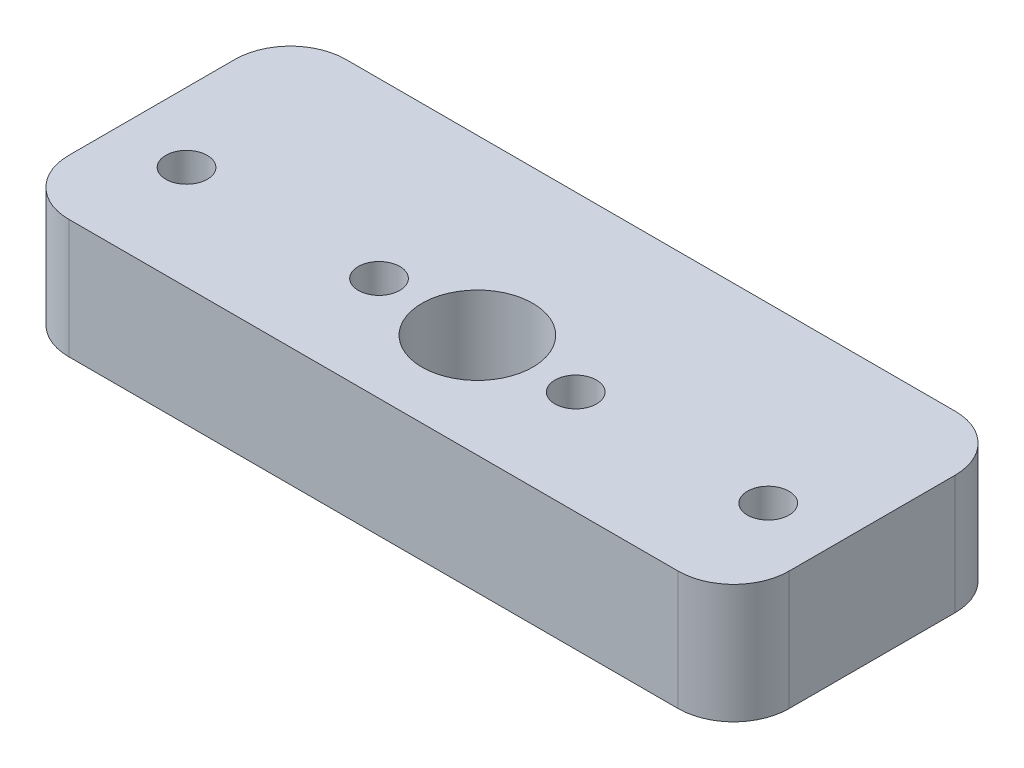
ISO-10303-21;
HEADER;
FILE_DESCRIPTION(('STEP AP214'),'2;1');
FILE_NAME('part.step','',(''),(''),'','','');
FILE_SCHEMA(('AUTOMOTIVE_DESIGN { 1 0 10303 214 1 1 1 1 }'));
ENDSEC;
DATA;
#1=APPLICATION_CONTEXT('core data for automotive mechanical design processes');
#2=APPLICATION_PROTOCOL_DEFINITION('international standard','automotive_design',2000,#1);
#3=PRODUCT_CONTEXT('',#1,'mechanical');
#4=PRODUCT('Part','Part','',(#3));
#5=PRODUCT_RELATED_PRODUCT_CATEGORY('part','',(#4));
#6=PRODUCT_DEFINITION_FORMATION('','',#4);
#7=PRODUCT_DEFINITION_CONTEXT('part definition',#1,'design');
#8=PRODUCT_DEFINITION('design','',#6,#7);
#9=PRODUCT_DEFINITION_SHAPE('','',#8);
#10=(LENGTH_UNIT() NAMED_UNIT(*) SI_UNIT(.MILLI.,.METRE.));
#11=(NAMED_UNIT(*) PLANE_ANGLE_UNIT() SI_UNIT($,.RADIAN.));
#12=(NAMED_UNIT(*) SI_UNIT($,.STERADIAN.) SOLID_ANGLE_UNIT());
#13=UNCERTAINTY_MEASURE_WITH_UNIT(LENGTH_MEASURE(1.E-05),#10,'distance_accuracy_value','');
#14=(GEOMETRIC_REPRESENTATION_CONTEXT(3) GLOBAL_UNCERTAINTY_ASSIGNED_CONTEXT((#13)) GLOBAL_UNIT_ASSIGNED_CONTEXT((#10,
#11,#12)) REPRESENTATION_CONTEXT('',''));
#15=CARTESIAN_POINT('',(0.,0.,0.));
#16=DIRECTION('',(0.,0.,1.));
#17=DIRECTION('',(1.,0.,0.));
#18=AXIS2_PLACEMENT_3D('',#15,#16,#17);
#19=CARTESIAN_POINT('',(-22.,8.6,6.));
#20=DIRECTION('',(0.,1.,0.));
#21=DIRECTION('',(0.,0.,1.));
#22=AXIS2_PLACEMENT_3D('',#19,#20,#21);
#23=PLANE('',#22);
#24=CARTESIAN_POINT('',(-21.,8.6,2.49999999999999));
#25=DIRECTION('',(0.,1.,0.));
#26=DIRECTION('',(0.,0.,-1.));
#27=AXIS2_PLACEMENT_3D('',#24,#25,#26);
#28=CIRCLE('',#27,1.5);
#29=CARTESIAN_POINT('',(-21.,8.6,0.999999999999989));
#30=VERTEX_POINT('',#29);
#31=EDGE_CURVE('E194',#30,#30,#28,.T.);
#32=ORIENTED_EDGE('',*,*,#31,.F.);
#33=EDGE_LOOP('',(#32));
#34=FACE_BOUND('',#33,.T.);
#35=CARTESIAN_POINT('',(7.1,8.6,2.49999999999999));
#36=DIRECTION('',(0.,1.,0.));
#37=DIRECTION('',(0.,0.,1.));
#38=AXIS2_PLACEMENT_3D('',#35,#36,#37);
#39=CIRCLE('',#38,1.5);
#40=CARTESIAN_POINT('',(7.1,8.6,3.99999999999999));
#41=VERTEX_POINT('',#40);
#42=EDGE_CURVE('E182',#41,#41,#39,.T.);
#43=ORIENTED_EDGE('',*,*,#42,.F.);
#44=EDGE_LOOP('',(#43));
#45=FACE_BOUND('',#44,.T.);
#46=CARTESIAN_POINT('',(-22.,8.6,6.));
#47=DIRECTION('',(0.,1.,0.));
#48=DIRECTION('',(0.,0.,1.));
#49=AXIS2_PLACEMENT_3D('',#46,#47,#48);
#50=CIRCLE('',#49,4.);
#51=CARTESIAN_POINT('',(-26.,8.6,5.99999999999997));
#52=VERTEX_POINT('',#51);
#53=CARTESIAN_POINT('',(-22.,8.6,10.));
#54=VERTEX_POINT('',#53);
#55=EDGE_CURVE('E145',#52,#54,#50,.T.);
#56=ORIENTED_EDGE('',*,*,#55,.T.);
#57=DIRECTION('',(1.,0.,0.));
#58=VECTOR('',#57,1.);
#59=CARTESIAN_POINT('',(-22.,8.6,10.));
#60=LINE('',#59,#58);
#61=CARTESIAN_POINT('',(22.,8.6,9.99999999999999));
#62=VERTEX_POINT('',#61);
#63=EDGE_CURVE('E93',#54,#62,#60,.T.);
#64=ORIENTED_EDGE('',*,*,#63,.T.);
#65=CARTESIAN_POINT('',(22.,8.6,6.));
#66=DIRECTION('',(0.,1.,0.));
#67=DIRECTION('',(0.,0.,1.));
#68=AXIS2_PLACEMENT_3D('',#65,#66,#67);
#69=CIRCLE('',#68,4.);
#70=CARTESIAN_POINT('',(26.,8.6,5.99999999999997));
#71=VERTEX_POINT('',#70);
#72=EDGE_CURVE('E160',#62,#71,#69,.T.);
#73=ORIENTED_EDGE('',*,*,#72,.T.);
#74=DIRECTION('',(0.,0.,-1.));
#75=VECTOR('',#74,1.);
#76=CARTESIAN_POINT('',(26.,8.6,-5.99999999999997));
#77=LINE('',#76,#75);
#78=CARTESIAN_POINT('',(26.,8.6,-5.99999999999998));
#79=VERTEX_POINT('',#78);
#80=EDGE_CURVE('E173',#71,#79,#77,.T.);
#81=ORIENTED_EDGE('',*,*,#80,.T.);
#82=CARTESIAN_POINT('',(22.,8.6,-6.));
#83=DIRECTION('',(0.,1.,0.));
#84=DIRECTION('',(0.,0.,-1.));
#85=AXIS2_PLACEMENT_3D('',#82,#83,#84);
#86=CIRCLE('',#85,4.);
#87=CARTESIAN_POINT('',(22.,8.6,-10.));
#88=VERTEX_POINT('',#87);
#89=EDGE_CURVE('E112',#79,#88,#86,.T.);
#90=ORIENTED_EDGE('',*,*,#89,.T.);
#91=DIRECTION('',(-1.,0.,0.));
#92=VECTOR('',#91,1.);
#93=CARTESIAN_POINT('',(-22.,8.6,-10.));
#94=LINE('',#93,#92);
#95=CARTESIAN_POINT('',(-22.,8.6,-10.));
#96=VERTEX_POINT('',#95);
#97=EDGE_CURVE('E106',#88,#96,#94,.T.);
#98=ORIENTED_EDGE('',*,*,#97,.T.);
#99=CARTESIAN_POINT('',(-22.,8.6,-6.));
#100=DIRECTION('',(0.,1.,0.));
#101=DIRECTION('',(0.,0.,1.));
#102=AXIS2_PLACEMENT_3D('',#99,#100,#101);
#103=CIRCLE('',#102,4.);
#104=CARTESIAN_POINT('',(-26.,8.6,-5.99999999999998));
#105=VERTEX_POINT('',#104);
#106=EDGE_CURVE('E110',#96,#105,#103,.T.);
#107=ORIENTED_EDGE('',*,*,#106,.T.);
#108=DIRECTION('',(0.,0.,1.));
#109=VECTOR('',#108,1.);
#110=CARTESIAN_POINT('',(-26.,8.6,-5.99999999999998));
#111=LINE('',#110,#109);
#112=EDGE_CURVE('E50',#105,#52,#111,.T.);
#113=ORIENTED_EDGE('',*,*,#112,.T.);
#114=EDGE_LOOP('',(#56,#64,#73,#81,#90,#98,#107,#113));
#115=FACE_BOUND('',#114,.T.);
#116=CARTESIAN_POINT('',(0.,8.6,2.49999999999999));
#117=DIRECTION('',(0.,1.,0.));
#118=DIRECTION('',(0.,0.,1.));
#119=AXIS2_PLACEMENT_3D('',#116,#117,#118);
#120=CIRCLE('',#119,4.);
#121=CARTESIAN_POINT('',(0.,8.6,6.49999999999999));
#122=VERTEX_POINT('',#121);
#123=EDGE_CURVE('E134',#122,#122,#120,.T.);
#124=ORIENTED_EDGE('',*,*,#123,.F.);
#125=EDGE_LOOP('',(#124));
#126=FACE_BOUND('',#125,.T.);
#127=CARTESIAN_POINT('',(21.,8.6,2.49999999999999));
#128=DIRECTION('',(0.,1.,0.));
#129=DIRECTION('',(0.,0.,1.));
#130=AXIS2_PLACEMENT_3D('',#127,#128,#129);
#131=CIRCLE('',#130,1.5);
#132=CARTESIAN_POINT('',(21.,8.6,3.99999999999999));
#133=VERTEX_POINT('',#132);
#134=EDGE_CURVE('E188',#133,#133,#131,.T.);
#135=ORIENTED_EDGE('',*,*,#134,.F.);
#136=EDGE_LOOP('',(#135));
#137=FACE_BOUND('',#136,.T.);
#138=CARTESIAN_POINT('',(-7.1,8.6,2.49999999999999));
#139=DIRECTION('',(0.,1.,0.));
#140=DIRECTION('',(0.,0.,-1.));
#141=AXIS2_PLACEMENT_3D('',#138,#139,#140);
#142=CIRCLE('',#141,1.5);
#143=CARTESIAN_POINT('',(-7.1,8.6,0.99999999999999));
#144=VERTEX_POINT('',#143);
#145=EDGE_CURVE('E200',#144,#144,#142,.T.);
#146=ORIENTED_EDGE('',*,*,#145,.F.);
#147=EDGE_LOOP('',(#146));
#148=FACE_BOUND('',#147,.T.);
#149=ADVANCED_FACE('F33',(#34,#45,#115,#126,#137,#148),#23,.T.);
#150=CARTESIAN_POINT('',(-22.,0.,6.));
#151=DIRECTION('',(0.,1.,0.));
#152=DIRECTION('',(0.,0.,1.));
#153=AXIS2_PLACEMENT_3D('',#150,#151,#152);
#154=PLANE('',#153);
#155=CARTESIAN_POINT('',(-21.,0.,2.49999999999999));
#156=DIRECTION('',(0.,1.,0.));
#157=DIRECTION('',(0.,0.,-1.));
#158=AXIS2_PLACEMENT_3D('',#155,#156,#157);
#159=CIRCLE('',#158,1.5);
#160=CARTESIAN_POINT('',(-21.,0.,0.999999999999989));
#161=VERTEX_POINT('',#160);
#162=EDGE_CURVE('E197',#161,#161,#159,.T.);
#163=ORIENTED_EDGE('',*,*,#162,.T.);
#164=EDGE_LOOP('',(#163));
#165=FACE_BOUND('',#164,.T.);
#166=CARTESIAN_POINT('',(7.1,0.,2.49999999999999));
#167=DIRECTION('',(0.,1.,0.));
#168=DIRECTION('',(0.,0.,1.));
#169=AXIS2_PLACEMENT_3D('',#166,#167,#168);
#170=CIRCLE('',#169,1.5);
#171=CARTESIAN_POINT('',(7.1,0.,3.99999999999999));
#172=VERTEX_POINT('',#171);
#173=EDGE_CURVE('E185',#172,#172,#170,.T.);
#174=ORIENTED_EDGE('',*,*,#173,.T.);
#175=EDGE_LOOP('',(#174));
#176=FACE_BOUND('',#175,.T.);
#177=CARTESIAN_POINT('',(-22.,0.,6.));
#178=DIRECTION('',(0.,1.,0.));
#179=DIRECTION('',(0.,0.,1.));
#180=AXIS2_PLACEMENT_3D('',#177,#178,#179);
#181=CIRCLE('',#180,4.);
#182=CARTESIAN_POINT('',(-26.,0.,5.99999999999997));
#183=VERTEX_POINT('',#182);
#184=CARTESIAN_POINT('',(-22.,0.,10.));
#185=VERTEX_POINT('',#184);
#186=EDGE_CURVE('E130',#183,#185,#181,.T.);
#187=ORIENTED_EDGE('',*,*,#186,.F.);
#188=DIRECTION('',(0.,0.,1.));
#189=VECTOR('',#188,1.);
#190=CARTESIAN_POINT('',(-26.,0.,-5.99999999999998));
#191=LINE('',#190,#189);
#192=CARTESIAN_POINT('',(-26.,0.,-5.99999999999998));
#193=VERTEX_POINT('',#192);
#194=EDGE_CURVE('E85',#193,#183,#191,.T.);
#195=ORIENTED_EDGE('',*,*,#194,.F.);
#196=CARTESIAN_POINT('',(-22.,0.,-6.));
#197=DIRECTION('',(0.,1.,0.));
#198=DIRECTION('',(0.,0.,1.));
#199=AXIS2_PLACEMENT_3D('',#196,#197,#198);
#200=CIRCLE('',#199,4.);
#201=CARTESIAN_POINT('',(-22.,0.,-10.));
#202=VERTEX_POINT('',#201);
#203=EDGE_CURVE('E79',#202,#193,#200,.T.);
#204=ORIENTED_EDGE('',*,*,#203,.F.);
#205=DIRECTION('',(-1.,0.,0.));
#206=VECTOR('',#205,1.);
#207=CARTESIAN_POINT('',(-22.,0.,-10.));
#208=LINE('',#207,#206);
#209=CARTESIAN_POINT('',(22.,0.,-10.));
#210=VERTEX_POINT('',#209);
#211=EDGE_CURVE('E120',#210,#202,#208,.T.);
#212=ORIENTED_EDGE('',*,*,#211,.F.);
#213=CARTESIAN_POINT('',(22.,0.,-6.));
#214=DIRECTION('',(0.,1.,0.));
#215=DIRECTION('',(0.,0.,-1.));
#216=AXIS2_PLACEMENT_3D('',#213,#214,#215);
#217=CIRCLE('',#216,4.);
#218=CARTESIAN_POINT('',(26.,0.,-5.99999999999998));
#219=VERTEX_POINT('',#218);
#220=EDGE_CURVE('E140',#219,#210,#217,.T.);
#221=ORIENTED_EDGE('',*,*,#220,.F.);
#222=DIRECTION('',(0.,0.,-1.));
#223=VECTOR('',#222,1.);
#224=CARTESIAN_POINT('',(26.,0.,-5.99999999999997));
#225=LINE('',#224,#223);
#226=CARTESIAN_POINT('',(26.,0.,5.99999999999997));
#227=VERTEX_POINT('',#226);
#228=EDGE_CURVE('E138',#227,#219,#225,.T.);
#229=ORIENTED_EDGE('',*,*,#228,.F.);
#230=CARTESIAN_POINT('',(22.,0.,6.));
#231=DIRECTION('',(0.,1.,0.));
#232=DIRECTION('',(0.,0.,1.));
#233=AXIS2_PLACEMENT_3D('',#230,#231,#232);
#234=CIRCLE('',#233,4.);
#235=CARTESIAN_POINT('',(22.,0.,9.99999999999999));
#236=VERTEX_POINT('',#235);
#237=EDGE_CURVE('E136',#236,#227,#234,.T.);
#238=ORIENTED_EDGE('',*,*,#237,.F.);
#239=DIRECTION('',(1.,0.,0.));
#240=VECTOR('',#239,1.);
#241=CARTESIAN_POINT('',(-22.,0.,10.));
#242=LINE('',#241,#240);
#243=EDGE_CURVE('E133',#185,#236,#242,.T.);
#244=ORIENTED_EDGE('',*,*,#243,.F.);
#245=EDGE_LOOP('',(#187,#195,#204,#212,#221,#229,#238,#244));
#246=FACE_BOUND('',#245,.T.);
#247=CARTESIAN_POINT('',(0.,0.,2.49999999999999));
#248=DIRECTION('',(0.,1.,0.));
#249=DIRECTION('',(0.,0.,1.));
#250=AXIS2_PLACEMENT_3D('',#247,#248,#249);
#251=CIRCLE('',#250,4.);
#252=CARTESIAN_POINT('',(0.,0.,6.49999999999999));
#253=VERTEX_POINT('',#252);
#254=EDGE_CURVE('E179',#253,#253,#251,.T.);
#255=ORIENTED_EDGE('',*,*,#254,.T.);
#256=EDGE_LOOP('',(#255));
#257=FACE_BOUND('',#256,.T.);
#258=CARTESIAN_POINT('',(21.,0.,2.49999999999999));
#259=DIRECTION('',(0.,1.,0.));
#260=DIRECTION('',(0.,0.,1.));
#261=AXIS2_PLACEMENT_3D('',#258,#259,#260);
#262=CIRCLE('',#261,1.5);
#263=CARTESIAN_POINT('',(21.,0.,3.99999999999999));
#264=VERTEX_POINT('',#263);
#265=EDGE_CURVE('E191',#264,#264,#262,.T.);
#266=ORIENTED_EDGE('',*,*,#265,.T.);
#267=EDGE_LOOP('',(#266));
#268=FACE_BOUND('',#267,.T.);
#269=CARTESIAN_POINT('',(-7.1,0.,2.49999999999999));
#270=DIRECTION('',(0.,1.,0.));
#271=DIRECTION('',(0.,0.,-1.));
#272=AXIS2_PLACEMENT_3D('',#269,#270,#271);
#273=CIRCLE('',#272,1.5);
#274=CARTESIAN_POINT('',(-7.1,0.,0.99999999999999));
#275=VERTEX_POINT('',#274);
#276=EDGE_CURVE('E203',#275,#275,#273,.T.);
#277=ORIENTED_EDGE('',*,*,#276,.T.);
#278=EDGE_LOOP('',(#277));
#279=FACE_BOUND('',#278,.T.);
#280=ADVANCED_FACE('F164',(#165,#176,#246,#257,#268,#279),#154,.F.);
#281=CARTESIAN_POINT('',(-22.,8.6,6.));
#282=DIRECTION('',(0.,-1.,0.));
#283=DIRECTION('',(0.,0.,-1.));
#284=AXIS2_PLACEMENT_3D('',#281,#282,#283);
#285=CYLINDRICAL_SURFACE('',#284,4.);
#286=ORIENTED_EDGE('',*,*,#186,.T.);
#287=DIRECTION('',(0.,-1.,0.));
#288=VECTOR('',#287,1.);
#289=CARTESIAN_POINT('',(-22.,8.6,10.));
#290=LINE('',#289,#288);
#291=EDGE_CURVE('E11',#54,#185,#290,.T.);
#292=ORIENTED_EDGE('',*,*,#291,.F.);
#293=ORIENTED_EDGE('',*,*,#55,.F.);
#294=DIRECTION('',(0.,-1.,0.));
#295=VECTOR('',#294,1.);
#296=CARTESIAN_POINT('',(-26.,8.6,5.99999999999997));
#297=LINE('',#296,#295);
#298=EDGE_CURVE('E126',#52,#183,#297,.T.);
#299=ORIENTED_EDGE('',*,*,#298,.T.);
#300=EDGE_LOOP('',(#286,#292,#293,#299));
#301=FACE_BOUND('',#300,.T.);
#302=ADVANCED_FACE('F35',(#301),#285,.T.);
#303=CARTESIAN_POINT('',(-22.,8.6,10.));
#304=DIRECTION('',(0.,0.,-1.));
#305=DIRECTION('',(-1.,0.,0.));
#306=AXIS2_PLACEMENT_3D('',#303,#304,#305);
#307=PLANE('',#306);
#308=ORIENTED_EDGE('',*,*,#243,.T.);
#309=DIRECTION('',(0.,-1.,0.));
#310=VECTOR('',#309,1.);
#311=CARTESIAN_POINT('',(22.,8.6,9.99999999999999));
#312=LINE('',#311,#310);
#313=EDGE_CURVE('E42',#62,#236,#312,.T.);
#314=ORIENTED_EDGE('',*,*,#313,.F.);
#315=ORIENTED_EDGE('',*,*,#63,.F.);
#316=ORIENTED_EDGE('',*,*,#291,.T.);
#317=EDGE_LOOP('',(#308,#314,#315,#316));
#318=FACE_BOUND('',#317,.T.);
#319=ADVANCED_FACE('F238',(#318),#307,.F.);
#320=CARTESIAN_POINT('',(22.,8.6,6.));
#321=DIRECTION('',(0.,-1.,0.));
#322=DIRECTION('',(0.,0.,-1.));
#323=AXIS2_PLACEMENT_3D('',#320,#321,#322);
#324=CYLINDRICAL_SURFACE('',#323,4.);
#325=ORIENTED_EDGE('',*,*,#237,.T.);
#326=DIRECTION('',(0.,-1.,0.));
#327=VECTOR('',#326,1.);
#328=CARTESIAN_POINT('',(26.,8.6,5.99999999999997));
#329=LINE('',#328,#327);
#330=EDGE_CURVE('E152',#71,#227,#329,.T.);
#331=ORIENTED_EDGE('',*,*,#330,.F.);
#332=ORIENTED_EDGE('',*,*,#72,.F.);
#333=ORIENTED_EDGE('',*,*,#313,.T.);
#334=EDGE_LOOP('',(#325,#331,#332,#333));
#335=FACE_BOUND('',#334,.T.);
#336=ADVANCED_FACE('F158',(#335),#324,.T.);
#337=CARTESIAN_POINT('',(26.,8.6,-5.99999999999997));
#338=DIRECTION('',(-1.,0.,0.));
#339=DIRECTION('',(0.,0.,1.));
#340=AXIS2_PLACEMENT_3D('',#337,#338,#339);
#341=PLANE('',#340);
#342=ORIENTED_EDGE('',*,*,#228,.T.);
#343=DIRECTION('',(0.,-1.,0.));
#344=VECTOR('',#343,1.);
#345=CARTESIAN_POINT('',(26.,8.6,-5.99999999999998));
#346=LINE('',#345,#344);
#347=EDGE_CURVE('E149',#79,#219,#346,.T.);
#348=ORIENTED_EDGE('',*,*,#347,.F.);
#349=ORIENTED_EDGE('',*,*,#80,.F.);
#350=ORIENTED_EDGE('',*,*,#330,.T.);
#351=EDGE_LOOP('',(#342,#348,#349,#350));
#352=FACE_BOUND('',#351,.T.);
#353=ADVANCED_FACE('F169',(#352),#341,.F.);
#354=CARTESIAN_POINT('',(22.,8.6,-6.));
#355=DIRECTION('',(0.,-1.,0.));
#356=DIRECTION('',(0.,0.,-1.));
#357=AXIS2_PLACEMENT_3D('',#354,#355,#356);
#358=CYLINDRICAL_SURFACE('',#357,4.);
#359=ORIENTED_EDGE('',*,*,#220,.T.);
#360=DIRECTION('',(0.,-1.,0.));
#361=VECTOR('',#360,1.);
#362=CARTESIAN_POINT('',(22.,8.6,-10.));
#363=LINE('',#362,#361);
#364=EDGE_CURVE('E121',#88,#210,#363,.T.);
#365=ORIENTED_EDGE('',*,*,#364,.F.);
#366=ORIENTED_EDGE('',*,*,#89,.F.);
#367=ORIENTED_EDGE('',*,*,#347,.T.);
#368=EDGE_LOOP('',(#359,#365,#366,#367));
#369=FACE_BOUND('',#368,.T.);
#370=ADVANCED_FACE('F172',(#369),#358,.T.);
#371=CARTESIAN_POINT('',(-22.,8.6,-10.));
#372=DIRECTION('',(0.,0.,1.));
#373=DIRECTION('',(1.,0.,0.));
#374=AXIS2_PLACEMENT_3D('',#371,#372,#373);
#375=PLANE('',#374);
#376=ORIENTED_EDGE('',*,*,#211,.T.);
#377=DIRECTION('',(0.,-1.,0.));
#378=VECTOR('',#377,1.);
#379=CARTESIAN_POINT('',(-22.,8.6,-10.));
#380=LINE('',#379,#378);
#381=EDGE_CURVE('E117',#96,#202,#380,.T.);
#382=ORIENTED_EDGE('',*,*,#381,.F.);
#383=ORIENTED_EDGE('',*,*,#97,.F.);
#384=ORIENTED_EDGE('',*,*,#364,.T.);
#385=EDGE_LOOP('',(#376,#382,#383,#384));
#386=FACE_BOUND('',#385,.T.);
#387=ADVANCED_FACE('F118',(#386),#375,.F.);
#388=CARTESIAN_POINT('',(-22.,8.6,-6.));
#389=DIRECTION('',(0.,-1.,0.));
#390=DIRECTION('',(0.,0.,-1.));
#391=AXIS2_PLACEMENT_3D('',#388,#389,#390);
#392=CYLINDRICAL_SURFACE('',#391,4.);
#393=ORIENTED_EDGE('',*,*,#203,.T.);
#394=DIRECTION('',(0.,-1.,0.));
#395=VECTOR('',#394,1.);
#396=CARTESIAN_POINT('',(-26.,8.6,-5.99999999999998));
#397=LINE('',#396,#395);
#398=EDGE_CURVE('E122',#105,#193,#397,.T.);
#399=ORIENTED_EDGE('',*,*,#398,.F.);
#400=ORIENTED_EDGE('',*,*,#106,.F.);
#401=ORIENTED_EDGE('',*,*,#381,.T.);
#402=EDGE_LOOP('',(#393,#399,#400,#401));
#403=FACE_BOUND('',#402,.T.);
#404=ADVANCED_FACE('F124',(#403),#392,.T.);
#405=CARTESIAN_POINT('',(-26.,8.6,-5.99999999999998));
#406=DIRECTION('',(1.,0.,0.));
#407=DIRECTION('',(0.,0.,-1.));
#408=AXIS2_PLACEMENT_3D('',#405,#406,#407);
#409=PLANE('',#408);
#410=ORIENTED_EDGE('',*,*,#194,.T.);
#411=ORIENTED_EDGE('',*,*,#298,.F.);
#412=ORIENTED_EDGE('',*,*,#112,.F.);
#413=ORIENTED_EDGE('',*,*,#398,.T.);
#414=EDGE_LOOP('',(#410,#411,#412,#413));
#415=FACE_BOUND('',#414,.T.);
#416=ADVANCED_FACE('F226',(#415),#409,.F.);
#417=CARTESIAN_POINT('',(0.,8.6,2.49999999999999));
#418=DIRECTION('',(0.,-1.,0.));
#419=DIRECTION('',(0.,0.,-1.));
#420=AXIS2_PLACEMENT_3D('',#417,#418,#419);
#421=CYLINDRICAL_SURFACE('',#420,4.);
#422=ORIENTED_EDGE('',*,*,#123,.T.);
#423=EDGE_LOOP('',(#422));
#424=FACE_BOUND('',#423,.T.);
#425=ORIENTED_EDGE('',*,*,#254,.F.);
#426=EDGE_LOOP('',(#425));
#427=FACE_BOUND('',#426,.T.);
#428=ADVANCED_FACE('F223',(#424,#427),#421,.F.);
#429=CARTESIAN_POINT('',(7.1,8.6,2.49999999999999));
#430=DIRECTION('',(0.,-1.,0.));
#431=DIRECTION('',(0.,0.,-1.));
#432=AXIS2_PLACEMENT_3D('',#429,#430,#431);
#433=CYLINDRICAL_SURFACE('',#432,1.5);
#434=ORIENTED_EDGE('',*,*,#42,.T.);
#435=EDGE_LOOP('',(#434));
#436=FACE_BOUND('',#435,.T.);
#437=ORIENTED_EDGE('',*,*,#173,.F.);
#438=EDGE_LOOP('',(#437));
#439=FACE_BOUND('',#438,.T.);
#440=ADVANCED_FACE('F302',(#436,#439),#433,.F.);
#441=CARTESIAN_POINT('',(21.,8.6,2.49999999999999));
#442=DIRECTION('',(0.,-1.,0.));
#443=DIRECTION('',(0.,0.,-1.));
#444=AXIS2_PLACEMENT_3D('',#441,#442,#443);
#445=CYLINDRICAL_SURFACE('',#444,1.5);
#446=ORIENTED_EDGE('',*,*,#134,.T.);
#447=EDGE_LOOP('',(#446));
#448=FACE_BOUND('',#447,.T.);
#449=ORIENTED_EDGE('',*,*,#265,.F.);
#450=EDGE_LOOP('',(#449));
#451=FACE_BOUND('',#450,.T.);
#452=ADVANCED_FACE('F310',(#448,#451),#445,.F.);
#453=CARTESIAN_POINT('',(-21.,8.6,2.49999999999999));
#454=DIRECTION('',(0.,-1.,0.));
#455=DIRECTION('',(0.,0.,-1.));
#456=AXIS2_PLACEMENT_3D('',#453,#454,#455);
#457=CYLINDRICAL_SURFACE('',#456,1.5);
#458=ORIENTED_EDGE('',*,*,#31,.T.);
#459=EDGE_LOOP('',(#458));
#460=FACE_BOUND('',#459,.T.);
#461=ORIENTED_EDGE('',*,*,#162,.F.);
#462=EDGE_LOOP('',(#461));
#463=FACE_BOUND('',#462,.T.);
#464=ADVANCED_FACE('F318',(#460,#463),#457,.F.);
#465=CARTESIAN_POINT('',(-7.1,8.6,2.49999999999999));
#466=DIRECTION('',(0.,-1.,0.));
#467=DIRECTION('',(0.,0.,-1.));
#468=AXIS2_PLACEMENT_3D('',#465,#466,#467);
#469=CYLINDRICAL_SURFACE('',#468,1.5);
#470=ORIENTED_EDGE('',*,*,#145,.T.);
#471=EDGE_LOOP('',(#470));
#472=FACE_BOUND('',#471,.T.);
#473=ORIENTED_EDGE('',*,*,#276,.F.);
#474=EDGE_LOOP('',(#473));
#475=FACE_BOUND('',#474,.T.);
#476=ADVANCED_FACE('F209',(#472,#475),#469,.F.);
#477=CLOSED_SHELL('',(#149,#280,#302,#319,#336,#353,#370,#387,#404,#416,#428,#440,#452,#464,#476));
#478=MANIFOLD_SOLID_BREP('B2',#477);
#479=ADVANCED_BREP_SHAPE_REPRESENTATION('',(#18,#478),#14);
#480=SHAPE_DEFINITION_REPRESENTATION(#9,#479);
ENDSEC;
END-ISO-10303-21;
